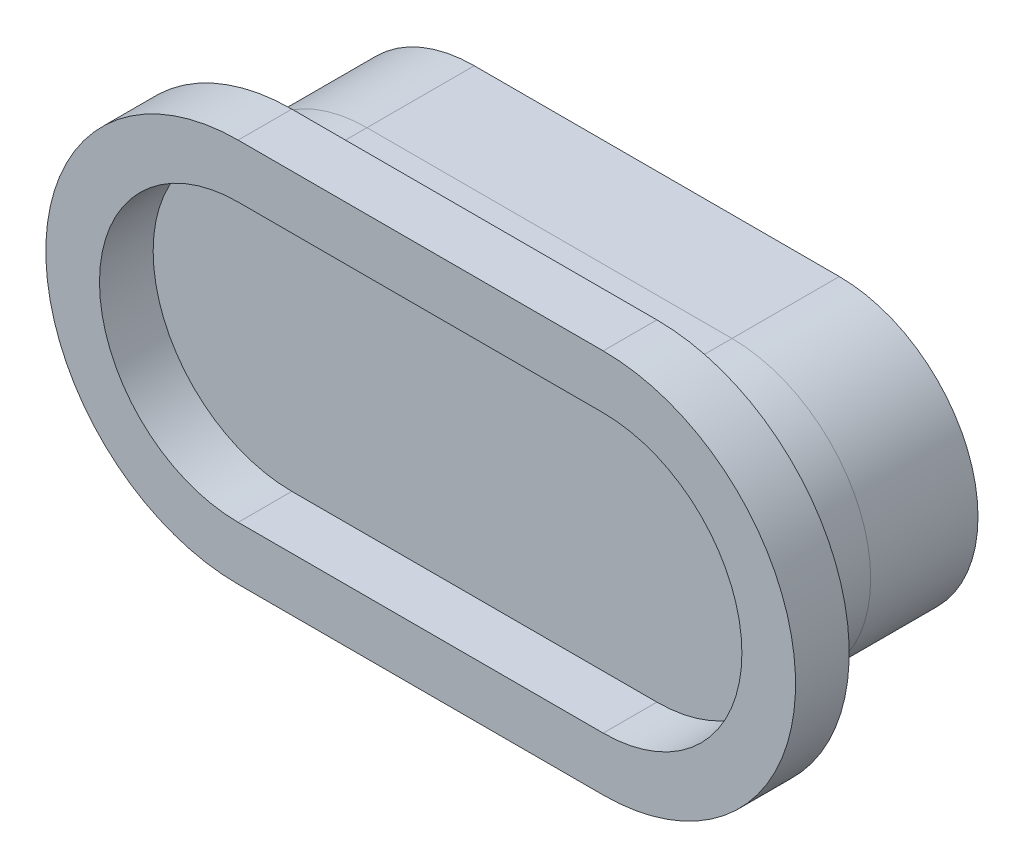
ISO-10303-21;
HEADER;
FILE_DESCRIPTION(('STEP AP214'),'2;1');
FILE_NAME('part.step','',(''),(''),'','','');
FILE_SCHEMA(('AUTOMOTIVE_DESIGN { 1 0 10303 214 1 1 1 1 }'));
ENDSEC;
DATA;
#1=APPLICATION_CONTEXT('core data for automotive mechanical design processes');
#2=APPLICATION_PROTOCOL_DEFINITION('international standard','automotive_design',2000,#1);
#3=PRODUCT_CONTEXT('',#1,'mechanical');
#4=PRODUCT('Part','Part','',(#3));
#5=PRODUCT_RELATED_PRODUCT_CATEGORY('part','',(#4));
#6=PRODUCT_DEFINITION_FORMATION('','',#4);
#7=PRODUCT_DEFINITION_CONTEXT('part definition',#1,'design');
#8=PRODUCT_DEFINITION('design','',#6,#7);
#9=PRODUCT_DEFINITION_SHAPE('','',#8);
#10=(LENGTH_UNIT() NAMED_UNIT(*) SI_UNIT(.MILLI.,.METRE.));
#11=(NAMED_UNIT(*) PLANE_ANGLE_UNIT() SI_UNIT($,.RADIAN.));
#12=(NAMED_UNIT(*) SI_UNIT($,.STERADIAN.) SOLID_ANGLE_UNIT());
#13=UNCERTAINTY_MEASURE_WITH_UNIT(LENGTH_MEASURE(1.E-05),#10,'distance_accuracy_value','');
#14=(GEOMETRIC_REPRESENTATION_CONTEXT(3) GLOBAL_UNCERTAINTY_ASSIGNED_CONTEXT((#13)) GLOBAL_UNIT_ASSIGNED_CONTEXT((#10,
#11,#12)) REPRESENTATION_CONTEXT('',''));
#15=CARTESIAN_POINT('',(0.,0.,0.));
#16=DIRECTION('',(0.,0.,1.));
#17=DIRECTION('',(1.,0.,0.));
#18=AXIS2_PLACEMENT_3D('',#15,#16,#17);
#19=CARTESIAN_POINT('',(68.0282062514295,0.,43.9999999999998));
#20=DIRECTION('',(0.,0.,1.));
#21=DIRECTION('',(1.,0.,0.));
#22=AXIS2_PLACEMENT_3D('',#19,#20,#21);
#23=PLANE('',#22);
#24=CARTESIAN_POINT('',(68.0282062514295,0.,43.9999999999998));
#25=DIRECTION('',(0.,0.,1.));
#26=DIRECTION('',(1.,0.,0.));
#27=AXIS2_PLACEMENT_3D('',#24,#25,#26);
#28=CIRCLE('',#27,35.8453618238699);
#29=CARTESIAN_POINT('',(68.0282062514295,-35.8453618238699,43.9999999999998));
#30=VERTEX_POINT('',#29);
#31=CARTESIAN_POINT('',(68.0282062514295,35.8453618238699,43.9999999999998));
#32=VERTEX_POINT('',#31);
#33=EDGE_CURVE('E175',#30,#32,#28,.T.);
#34=ORIENTED_EDGE('',*,*,#33,.T.);
#35=DIRECTION('',(-1.,0.,0.));
#36=VECTOR('',#35,1.);
#37=CARTESIAN_POINT('',(68.0282062514295,35.8453618238699,43.9999999999998));
#38=LINE('',#37,#36);
#39=CARTESIAN_POINT('',(0.,35.8453618238699,43.9999999999998));
#40=VERTEX_POINT('',#39);
#41=EDGE_CURVE('E178',#32,#40,#38,.T.);
#42=ORIENTED_EDGE('',*,*,#41,.T.);
#43=CARTESIAN_POINT('',(0.,0.,43.9999999999998));
#44=DIRECTION('',(0.,0.,1.));
#45=DIRECTION('',(1.,0.,0.));
#46=AXIS2_PLACEMENT_3D('',#43,#44,#45);
#47=CIRCLE('',#46,35.8453618238699);
#48=CARTESIAN_POINT('',(0.,-35.8453618238699,43.9999999999998));
#49=VERTEX_POINT('',#48);
#50=EDGE_CURVE('E181',#40,#49,#47,.T.);
#51=ORIENTED_EDGE('',*,*,#50,.T.);
#52=DIRECTION('',(1.,0.,0.));
#53=VECTOR('',#52,1.);
#54=CARTESIAN_POINT('',(0.,-35.8453618238699,43.9999999999998));
#55=LINE('',#54,#53);
#56=EDGE_CURVE('E183',#49,#30,#55,.T.);
#57=ORIENTED_EDGE('',*,*,#56,.T.);
#58=EDGE_LOOP('',(#34,#42,#51,#57));
#59=FACE_BOUND('',#58,.T.);
#60=DIRECTION('',(-1.,0.,0.));
#61=VECTOR('',#60,1.);
#62=CARTESIAN_POINT('',(68.0282062514295,25.8453618238699,43.9999999999998));
#63=LINE('',#62,#61);
#64=CARTESIAN_POINT('',(68.0282062514295,25.8453618238699,43.9999999999998));
#65=VERTEX_POINT('',#64);
#66=CARTESIAN_POINT('',(0.,25.8453618238699,43.9999999999998));
#67=VERTEX_POINT('',#66);
#68=EDGE_CURVE('E147',#65,#67,#63,.T.);
#69=ORIENTED_EDGE('',*,*,#68,.F.);
#70=CARTESIAN_POINT('',(68.0282062514295,0.,43.9999999999998));
#71=DIRECTION('',(0.,0.,1.));
#72=DIRECTION('',(1.,0.,0.));
#73=AXIS2_PLACEMENT_3D('',#70,#71,#72);
#74=CIRCLE('',#73,25.8453618238699);
#75=CARTESIAN_POINT('',(68.0282062514295,-25.8453618238699,43.9999999999998));
#76=VERTEX_POINT('',#75);
#77=EDGE_CURVE('E139',#76,#65,#74,.T.);
#78=ORIENTED_EDGE('',*,*,#77,.F.);
#79=DIRECTION('',(1.,0.,0.));
#80=VECTOR('',#79,1.);
#81=CARTESIAN_POINT('',(0.,-25.8453618238699,43.9999999999998));
#82=LINE('',#81,#80);
#83=CARTESIAN_POINT('',(0.,-25.8453618238699,43.9999999999998));
#84=VERTEX_POINT('',#83);
#85=EDGE_CURVE('E161',#84,#76,#82,.T.);
#86=ORIENTED_EDGE('',*,*,#85,.F.);
#87=CARTESIAN_POINT('',(0.,0.,43.9999999999998));
#88=DIRECTION('',(0.,0.,1.));
#89=DIRECTION('',(1.,0.,0.));
#90=AXIS2_PLACEMENT_3D('',#87,#88,#89);
#91=CIRCLE('',#90,25.8453618238699);
#92=EDGE_CURVE('E159',#67,#84,#91,.T.);
#93=ORIENTED_EDGE('',*,*,#92,.F.);
#94=EDGE_LOOP('',(#69,#78,#86,#93));
#95=FACE_BOUND('',#94,.T.);
#96=ADVANCED_FACE('F74',(#59,#95),#23,.T.);
#97=CARTESIAN_POINT('',(68.0282062514295,0.,33.9999999999998));
#98=DIRECTION('',(0.,0.,1.));
#99=DIRECTION('',(1.,0.,0.));
#100=AXIS2_PLACEMENT_3D('',#97,#98,#99);
#101=PLANE('',#100);
#102=CARTESIAN_POINT('',(68.0282062514295,0.,33.9999999999998));
#103=DIRECTION('',(0.,0.,1.));
#104=DIRECTION('',(1.,0.,0.));
#105=AXIS2_PLACEMENT_3D('',#102,#103,#104);
#106=CIRCLE('',#105,35.8453618238699);
#107=CARTESIAN_POINT('',(68.0282062514295,-35.8453618238699,33.9999999999998));
#108=VERTEX_POINT('',#107);
#109=CARTESIAN_POINT('',(68.0282062514295,35.8453618238699,33.9999999999998));
#110=VERTEX_POINT('',#109);
#111=EDGE_CURVE('E155',#108,#110,#106,.T.);
#112=ORIENTED_EDGE('',*,*,#111,.F.);
#113=DIRECTION('',(1.,0.,0.));
#114=VECTOR('',#113,1.);
#115=CARTESIAN_POINT('',(0.,-35.8453618238699,33.9999999999998));
#116=LINE('',#115,#114);
#117=CARTESIAN_POINT('',(0.,-35.8453618238699,33.9999999999998));
#118=VERTEX_POINT('',#117);
#119=EDGE_CURVE('E179',#118,#108,#116,.T.);
#120=ORIENTED_EDGE('',*,*,#119,.F.);
#121=CARTESIAN_POINT('',(0.,0.,33.9999999999998));
#122=DIRECTION('',(0.,0.,1.));
#123=DIRECTION('',(1.,0.,0.));
#124=AXIS2_PLACEMENT_3D('',#121,#122,#123);
#125=CIRCLE('',#124,35.8453618238699);
#126=CARTESIAN_POINT('',(0.,35.8453618238699,33.9999999999998));
#127=VERTEX_POINT('',#126);
#128=EDGE_CURVE('E190',#127,#118,#125,.T.);
#129=ORIENTED_EDGE('',*,*,#128,.F.);
#130=DIRECTION('',(-1.,0.,0.));
#131=VECTOR('',#130,1.);
#132=CARTESIAN_POINT('',(68.0282062514295,35.8453618238699,33.9999999999998));
#133=LINE('',#132,#131);
#134=EDGE_CURVE('E188',#110,#127,#133,.T.);
#135=ORIENTED_EDGE('',*,*,#134,.F.);
#136=EDGE_LOOP('',(#112,#120,#129,#135));
#137=FACE_BOUND('',#136,.T.);
#138=CARTESIAN_POINT('',(68.0282062514295,0.,33.9999999999998));
#139=DIRECTION('',(0.,0.,1.));
#140=DIRECTION('',(1.,0.,0.));
#141=AXIS2_PLACEMENT_3D('',#138,#139,#140);
#142=CIRCLE('',#141,25.8453618238699);
#143=CARTESIAN_POINT('',(68.0282062514295,-25.8453618238699,33.9999999999998));
#144=VERTEX_POINT('',#143);
#145=CARTESIAN_POINT('',(68.0282062514295,25.8453618238699,33.9999999999998));
#146=VERTEX_POINT('',#145);
#147=EDGE_CURVE('E97',#144,#146,#142,.T.);
#148=ORIENTED_EDGE('',*,*,#147,.T.);
#149=DIRECTION('',(-1.,0.,0.));
#150=VECTOR('',#149,1.);
#151=CARTESIAN_POINT('',(68.0282062514295,25.8453618238699,33.9999999999998));
#152=LINE('',#151,#150);
#153=CARTESIAN_POINT('',(0.,25.8453618238699,33.9999999999998));
#154=VERTEX_POINT('',#153);
#155=EDGE_CURVE('E154',#146,#154,#152,.T.);
#156=ORIENTED_EDGE('',*,*,#155,.T.);
#157=CARTESIAN_POINT('',(0.,0.,33.9999999999998));
#158=DIRECTION('',(0.,0.,1.));
#159=DIRECTION('',(1.,0.,0.));
#160=AXIS2_PLACEMENT_3D('',#157,#158,#159);
#161=CIRCLE('',#160,25.8453618238699);
#162=CARTESIAN_POINT('',(0.,-25.8453618238699,33.9999999999998));
#163=VERTEX_POINT('',#162);
#164=EDGE_CURVE('E167',#154,#163,#161,.T.);
#165=ORIENTED_EDGE('',*,*,#164,.T.);
#166=DIRECTION('',(1.,0.,0.));
#167=VECTOR('',#166,1.);
#168=CARTESIAN_POINT('',(0.,-25.8453618238699,33.9999999999998));
#169=LINE('',#168,#167);
#170=EDGE_CURVE('E148',#163,#144,#169,.T.);
#171=ORIENTED_EDGE('',*,*,#170,.T.);
#172=EDGE_LOOP('',(#148,#156,#165,#171));
#173=FACE_BOUND('',#172,.T.);
#174=ADVANCED_FACE('F208',(#137,#173),#101,.F.);
#175=CARTESIAN_POINT('',(68.0282062514295,0.,43.9999999999998));
#176=DIRECTION('',(0.,0.,-1.));
#177=DIRECTION('',(-1.,0.,0.));
#178=AXIS2_PLACEMENT_3D('',#175,#176,#177);
#179=CYLINDRICAL_SURFACE('',#178,35.8453618238699);
#180=ORIENTED_EDGE('',*,*,#111,.T.);
#181=DIRECTION('',(0.,0.,-1.));
#182=VECTOR('',#181,1.);
#183=CARTESIAN_POINT('',(68.0282062514295,35.8453618238699,43.9999999999998));
#184=LINE('',#183,#182);
#185=EDGE_CURVE('E13',#32,#110,#184,.T.);
#186=ORIENTED_EDGE('',*,*,#185,.F.);
#187=ORIENTED_EDGE('',*,*,#33,.F.);
#188=DIRECTION('',(0.,0.,-1.));
#189=VECTOR('',#188,1.);
#190=CARTESIAN_POINT('',(68.0282062514295,-35.8453618238699,43.9999999999998));
#191=LINE('',#190,#189);
#192=EDGE_CURVE('E185',#30,#108,#191,.T.);
#193=ORIENTED_EDGE('',*,*,#192,.T.);
#194=EDGE_LOOP('',(#180,#186,#187,#193));
#195=FACE_BOUND('',#194,.T.);
#196=ADVANCED_FACE('F76',(#195),#179,.T.);
#197=CARTESIAN_POINT('',(68.0282062514295,35.8453618238699,43.9999999999998));
#198=DIRECTION('',(0.,-1.,0.));
#199=DIRECTION('',(0.,0.,-1.));
#200=AXIS2_PLACEMENT_3D('',#197,#198,#199);
#201=PLANE('',#200);
#202=ORIENTED_EDGE('',*,*,#134,.T.);
#203=DIRECTION('',(0.,0.,-1.));
#204=VECTOR('',#203,1.);
#205=CARTESIAN_POINT('',(0.,35.8453618238699,43.9999999999998));
#206=LINE('',#205,#204);
#207=EDGE_CURVE('E82',#40,#127,#206,.T.);
#208=ORIENTED_EDGE('',*,*,#207,.F.);
#209=ORIENTED_EDGE('',*,*,#41,.F.);
#210=ORIENTED_EDGE('',*,*,#185,.T.);
#211=EDGE_LOOP('',(#202,#208,#209,#210));
#212=FACE_BOUND('',#211,.T.);
#213=ADVANCED_FACE('F218',(#212),#201,.F.);
#214=CARTESIAN_POINT('',(0.,0.,43.9999999999998));
#215=DIRECTION('',(0.,0.,-1.));
#216=DIRECTION('',(-1.,0.,0.));
#217=AXIS2_PLACEMENT_3D('',#214,#215,#216);
#218=CYLINDRICAL_SURFACE('',#217,35.8453618238699);
#219=ORIENTED_EDGE('',*,*,#128,.T.);
#220=DIRECTION('',(0.,0.,-1.));
#221=VECTOR('',#220,1.);
#222=CARTESIAN_POINT('',(0.,-35.8453618238699,43.9999999999998));
#223=LINE('',#222,#221);
#224=EDGE_CURVE('E195',#49,#118,#223,.T.);
#225=ORIENTED_EDGE('',*,*,#224,.F.);
#226=ORIENTED_EDGE('',*,*,#50,.F.);
#227=ORIENTED_EDGE('',*,*,#207,.T.);
#228=EDGE_LOOP('',(#219,#225,#226,#227));
#229=FACE_BOUND('',#228,.T.);
#230=ADVANCED_FACE('F202',(#229),#218,.T.);
#231=CARTESIAN_POINT('',(0.,-35.8453618238699,43.9999999999998));
#232=DIRECTION('',(0.,1.,0.));
#233=DIRECTION('',(0.,0.,1.));
#234=AXIS2_PLACEMENT_3D('',#231,#232,#233);
#235=PLANE('',#234);
#236=ORIENTED_EDGE('',*,*,#119,.T.);
#237=ORIENTED_EDGE('',*,*,#192,.F.);
#238=ORIENTED_EDGE('',*,*,#56,.F.);
#239=ORIENTED_EDGE('',*,*,#224,.T.);
#240=EDGE_LOOP('',(#236,#237,#238,#239));
#241=FACE_BOUND('',#240,.T.);
#242=ADVANCED_FACE('F212',(#241),#235,.F.);
#243=CARTESIAN_POINT('',(68.0282062514295,0.,43.9999999999998));
#244=DIRECTION('',(0.,0.,-1.));
#245=DIRECTION('',(-1.,0.,0.));
#246=AXIS2_PLACEMENT_3D('',#243,#244,#245);
#247=CYLINDRICAL_SURFACE('',#246,25.8453618238699);
#248=ORIENTED_EDGE('',*,*,#147,.F.);
#249=DIRECTION('',(0.,0.,-1.));
#250=VECTOR('',#249,1.);
#251=CARTESIAN_POINT('',(68.0282062514295,-25.8453618238699,43.9999999999998));
#252=LINE('',#251,#250);
#253=EDGE_CURVE('E143',#76,#144,#252,.T.);
#254=ORIENTED_EDGE('',*,*,#253,.F.);
#255=ORIENTED_EDGE('',*,*,#77,.T.);
#256=DIRECTION('',(0.,0.,-1.));
#257=VECTOR('',#256,1.);
#258=CARTESIAN_POINT('',(68.0282062514295,25.8453618238699,43.9999999999998));
#259=LINE('',#258,#257);
#260=EDGE_CURVE('E142',#65,#146,#259,.T.);
#261=ORIENTED_EDGE('',*,*,#260,.T.);
#262=EDGE_LOOP('',(#248,#254,#255,#261));
#263=FACE_BOUND('',#262,.T.);
#264=ADVANCED_FACE('F141',(#263),#247,.F.);
#265=CARTESIAN_POINT('',(68.0282062514295,25.8453618238699,43.9999999999998));
#266=DIRECTION('',(0.,-1.,0.));
#267=DIRECTION('',(0.,0.,-1.));
#268=AXIS2_PLACEMENT_3D('',#265,#266,#267);
#269=PLANE('',#268);
#270=ORIENTED_EDGE('',*,*,#155,.F.);
#271=ORIENTED_EDGE('',*,*,#260,.F.);
#272=ORIENTED_EDGE('',*,*,#68,.T.);
#273=DIRECTION('',(0.,0.,-1.));
#274=VECTOR('',#273,1.);
#275=CARTESIAN_POINT('',(0.,25.8453618238699,43.9999999999998));
#276=LINE('',#275,#274);
#277=EDGE_CURVE('E156',#67,#154,#276,.T.);
#278=ORIENTED_EDGE('',*,*,#277,.T.);
#279=EDGE_LOOP('',(#270,#271,#272,#278));
#280=FACE_BOUND('',#279,.T.);
#281=ADVANCED_FACE('F151',(#280),#269,.T.);
#282=CARTESIAN_POINT('',(0.,0.,43.9999999999998));
#283=DIRECTION('',(0.,0.,-1.));
#284=DIRECTION('',(-1.,0.,0.));
#285=AXIS2_PLACEMENT_3D('',#282,#283,#284);
#286=CYLINDRICAL_SURFACE('',#285,25.8453618238699);
#287=ORIENTED_EDGE('',*,*,#164,.F.);
#288=ORIENTED_EDGE('',*,*,#277,.F.);
#289=ORIENTED_EDGE('',*,*,#92,.T.);
#290=DIRECTION('',(0.,0.,-1.));
#291=VECTOR('',#290,1.);
#292=CARTESIAN_POINT('',(0.,-25.8453618238699,43.9999999999998));
#293=LINE('',#292,#291);
#294=EDGE_CURVE('E89',#84,#163,#293,.T.);
#295=ORIENTED_EDGE('',*,*,#294,.T.);
#296=EDGE_LOOP('',(#287,#288,#289,#295));
#297=FACE_BOUND('',#296,.T.);
#298=ADVANCED_FACE('F241',(#297),#286,.F.);
#299=CARTESIAN_POINT('',(0.,-25.8453618238699,43.9999999999998));
#300=DIRECTION('',(0.,1.,0.));
#301=DIRECTION('',(0.,0.,1.));
#302=AXIS2_PLACEMENT_3D('',#299,#300,#301);
#303=PLANE('',#302);
#304=ORIENTED_EDGE('',*,*,#170,.F.);
#305=ORIENTED_EDGE('',*,*,#294,.F.);
#306=ORIENTED_EDGE('',*,*,#85,.T.);
#307=ORIENTED_EDGE('',*,*,#253,.T.);
#308=EDGE_LOOP('',(#304,#305,#306,#307));
#309=FACE_BOUND('',#308,.T.);
#310=ADVANCED_FACE('F245',(#309),#303,.T.);
#311=CLOSED_SHELL('',(#96,#174,#196,#213,#230,#242,#264,#281,#298,#310));
#312=MANIFOLD_SOLID_BREP('B2',#311);
#313=CARTESIAN_POINT('',(68.0282062514295,25.8453618238699,33.9999999999998));
#314=DIRECTION('',(0.,-1.,0.));
#315=DIRECTION('',(0.,0.,-1.));
#316=AXIS2_PLACEMENT_3D('',#313,#314,#315);
#317=PLANE('',#316);
#318=DIRECTION('',(-1.,0.,0.));
#319=VECTOR('',#318,1.);
#320=CARTESIAN_POINT('',(68.0282062514295,25.8453618238699,20.));
#321=LINE('',#320,#319);
#322=CARTESIAN_POINT('',(68.0282062514295,25.8453618238699,20.));
#323=VERTEX_POINT('',#322);
#324=CARTESIAN_POINT('',(0.,25.8453618238699,20.));
#325=VERTEX_POINT('',#324);
#326=EDGE_CURVE('E376',#323,#325,#321,.T.);
#327=ORIENTED_EDGE('',*,*,#326,.T.);
#328=DIRECTION('',(0.,0.,-1.));
#329=VECTOR('',#328,1.);
#330=CARTESIAN_POINT('',(0.,25.8453618238699,33.9999999999998));
#331=LINE('',#330,#329);
#332=CARTESIAN_POINT('',(0.,25.8453618238699,33.9999999999998));
#333=VERTEX_POINT('',#332);
#334=EDGE_CURVE('E72',#333,#325,#331,.T.);
#335=ORIENTED_EDGE('',*,*,#334,.F.);
#336=DIRECTION('',(-1.,0.,0.));
#337=VECTOR('',#336,1.);
#338=CARTESIAN_POINT('',(68.0282062514295,25.8453618238699,33.9999999999998));
#339=LINE('',#338,#337);
#340=CARTESIAN_POINT('',(68.0282062514295,25.8453618238699,33.9999999999998));
#341=VERTEX_POINT('',#340);
#342=EDGE_CURVE('E364',#341,#333,#339,.T.);
#343=ORIENTED_EDGE('',*,*,#342,.F.);
#344=DIRECTION('',(0.,0.,-1.));
#345=VECTOR('',#344,1.);
#346=CARTESIAN_POINT('',(68.0282062514295,25.8453618238699,33.9999999999998));
#347=LINE('',#346,#345);
#348=EDGE_CURVE('E372',#341,#323,#347,.T.);
#349=ORIENTED_EDGE('',*,*,#348,.T.);
#350=EDGE_LOOP('',(#327,#335,#343,#349));
#351=FACE_BOUND('',#350,.T.);
#352=ADVANCED_FACE('F313',(#351),#317,.F.);
#353=CARTESIAN_POINT('',(0.,0.,33.9999999999998));
#354=DIRECTION('',(0.,0.,-1.));
#355=DIRECTION('',(-1.,0.,0.));
#356=AXIS2_PLACEMENT_3D('',#353,#354,#355);
#357=CYLINDRICAL_SURFACE('',#356,25.8453618238699);
#358=CARTESIAN_POINT('',(0.,0.,20.));
#359=DIRECTION('',(0.,0.,1.));
#360=DIRECTION('',(1.,0.,0.));
#361=AXIS2_PLACEMENT_3D('',#358,#359,#360);
#362=CIRCLE('',#361,25.8453618238699);
#363=CARTESIAN_POINT('',(0.,-25.8453618238699,20.));
#364=VERTEX_POINT('',#363);
#365=EDGE_CURVE('E368',#325,#364,#362,.T.);
#366=ORIENTED_EDGE('',*,*,#365,.T.);
#367=DIRECTION('',(0.,0.,-1.));
#368=VECTOR('',#367,1.);
#369=CARTESIAN_POINT('',(0.,-25.8453618238699,33.9999999999998));
#370=LINE('',#369,#368);
#371=CARTESIAN_POINT('',(0.,-25.8453618238699,33.9999999999998));
#372=VERTEX_POINT('',#371);
#373=EDGE_CURVE('E321',#372,#364,#370,.T.);
#374=ORIENTED_EDGE('',*,*,#373,.F.);
#375=CARTESIAN_POINT('',(0.,0.,33.9999999999998));
#376=DIRECTION('',(0.,0.,1.));
#377=DIRECTION('',(1.,0.,0.));
#378=AXIS2_PLACEMENT_3D('',#375,#376,#377);
#379=CIRCLE('',#378,25.8453618238699);
#380=EDGE_CURVE('E359',#333,#372,#379,.T.);
#381=ORIENTED_EDGE('',*,*,#380,.F.);
#382=ORIENTED_EDGE('',*,*,#334,.T.);
#383=EDGE_LOOP('',(#366,#374,#381,#382));
#384=FACE_BOUND('',#383,.T.);
#385=ADVANCED_FACE('F367',(#384),#357,.T.);
#386=CARTESIAN_POINT('',(0.,-25.8453618238699,33.9999999999998));
#387=DIRECTION('',(0.,1.,0.));
#388=DIRECTION('',(0.,0.,1.));
#389=AXIS2_PLACEMENT_3D('',#386,#387,#388);
#390=PLANE('',#389);
#391=DIRECTION('',(1.,0.,0.));
#392=VECTOR('',#391,1.);
#393=CARTESIAN_POINT('',(0.,-25.8453618238699,20.));
#394=LINE('',#393,#392);
#395=CARTESIAN_POINT('',(68.0282062514295,-25.8453618238699,20.));
#396=VERTEX_POINT('',#395);
#397=EDGE_CURVE('E346',#364,#396,#394,.T.);
#398=ORIENTED_EDGE('',*,*,#397,.T.);
#399=DIRECTION('',(0.,0.,-1.));
#400=VECTOR('',#399,1.);
#401=CARTESIAN_POINT('',(68.0282062514295,-25.8453618238699,33.9999999999998));
#402=LINE('',#401,#400);
#403=CARTESIAN_POINT('',(68.0282062514295,-25.8453618238699,33.9999999999998));
#404=VERTEX_POINT('',#403);
#405=EDGE_CURVE('E369',#404,#396,#402,.T.);
#406=ORIENTED_EDGE('',*,*,#405,.F.);
#407=DIRECTION('',(1.,0.,0.));
#408=VECTOR('',#407,1.);
#409=CARTESIAN_POINT('',(0.,-25.8453618238699,33.9999999999998));
#410=LINE('',#409,#408);
#411=EDGE_CURVE('E362',#372,#404,#410,.T.);
#412=ORIENTED_EDGE('',*,*,#411,.F.);
#413=ORIENTED_EDGE('',*,*,#373,.T.);
#414=EDGE_LOOP('',(#398,#406,#412,#413));
#415=FACE_BOUND('',#414,.T.);
#416=ADVANCED_FACE('F370',(#415),#390,.F.);
#417=CARTESIAN_POINT('',(68.0282062514295,0.,33.9999999999998));
#418=DIRECTION('',(0.,0.,-1.));
#419=DIRECTION('',(-1.,0.,0.));
#420=AXIS2_PLACEMENT_3D('',#417,#418,#419);
#421=CYLINDRICAL_SURFACE('',#420,25.8453618238699);
#422=CARTESIAN_POINT('',(68.0282062514295,0.,20.));
#423=DIRECTION('',(0.,0.,1.));
#424=DIRECTION('',(1.,0.,0.));
#425=AXIS2_PLACEMENT_3D('',#422,#423,#424);
#426=CIRCLE('',#425,25.8453618238699);
#427=EDGE_CURVE('E352',#396,#323,#426,.T.);
#428=ORIENTED_EDGE('',*,*,#427,.T.);
#429=ORIENTED_EDGE('',*,*,#348,.F.);
#430=CARTESIAN_POINT('',(68.0282062514295,0.,33.9999999999998));
#431=DIRECTION('',(0.,0.,1.));
#432=DIRECTION('',(1.,0.,0.));
#433=AXIS2_PLACEMENT_3D('',#430,#431,#432);
#434=CIRCLE('',#433,25.8453618238699);
#435=EDGE_CURVE('E329',#404,#341,#434,.T.);
#436=ORIENTED_EDGE('',*,*,#435,.F.);
#437=ORIENTED_EDGE('',*,*,#405,.T.);
#438=EDGE_LOOP('',(#428,#429,#436,#437));
#439=FACE_BOUND('',#438,.T.);
#440=ADVANCED_FACE('F383',(#439),#421,.T.);
#441=CARTESIAN_POINT('',(0.,0.,33.9999999999998));
#442=DIRECTION('',(0.,0.,1.));
#443=DIRECTION('',(1.,0.,0.));
#444=AXIS2_PLACEMENT_3D('',#441,#442,#443);
#445=PLANE('',#444);
#446=ORIENTED_EDGE('',*,*,#342,.T.);
#447=ORIENTED_EDGE('',*,*,#380,.T.);
#448=ORIENTED_EDGE('',*,*,#411,.T.);
#449=ORIENTED_EDGE('',*,*,#435,.T.);
#450=EDGE_LOOP('',(#446,#447,#448,#449));
#451=FACE_BOUND('',#450,.T.);
#452=ADVANCED_FACE('F360',(#451),#445,.T.);
#453=CARTESIAN_POINT('',(0.,0.,20.));
#454=DIRECTION('',(0.,0.,1.));
#455=DIRECTION('',(1.,0.,0.));
#456=AXIS2_PLACEMENT_3D('',#453,#454,#455);
#457=PLANE('',#456);
#458=ORIENTED_EDGE('',*,*,#326,.F.);
#459=ORIENTED_EDGE('',*,*,#427,.F.);
#460=ORIENTED_EDGE('',*,*,#397,.F.);
#461=ORIENTED_EDGE('',*,*,#365,.F.);
#462=EDGE_LOOP('',(#458,#459,#460,#461));
#463=FACE_BOUND('',#462,.T.);
#464=ADVANCED_FACE('F386',(#463),#457,.F.);
#465=CLOSED_SHELL('',(#352,#385,#416,#440,#452,#464));
#466=MANIFOLD_SOLID_BREP('B7',#465);
#467=CARTESIAN_POINT('',(0.,0.,20.));
#468=DIRECTION('',(0.,0.,-1.));
#469=DIRECTION('',(-1.,0.,0.));
#470=AXIS2_PLACEMENT_3D('',#467,#468,#469);
#471=CYLINDRICAL_SURFACE('',#470,25.8453618238699);
#472=CARTESIAN_POINT('',(0.,0.,0.));
#473=DIRECTION('',(0.,0.,1.));
#474=DIRECTION('',(1.,0.,0.));
#475=AXIS2_PLACEMENT_3D('',#472,#473,#474);
#476=CIRCLE('',#475,25.8453618238699);
#477=CARTESIAN_POINT('',(0.,25.8453618238699,0.));
#478=VERTEX_POINT('',#477);
#479=CARTESIAN_POINT('',(0.,-25.8453618238699,0.));
#480=VERTEX_POINT('',#479);
#481=EDGE_CURVE('E505',#478,#480,#476,.T.);
#482=ORIENTED_EDGE('',*,*,#481,.T.);
#483=DIRECTION('',(0.,0.,-1.));
#484=VECTOR('',#483,1.);
#485=CARTESIAN_POINT('',(0.,-25.8453618238699,20.));
#486=LINE('',#485,#484);
#487=CARTESIAN_POINT('',(0.,-25.8453618238699,20.));
#488=VERTEX_POINT('',#487);
#489=EDGE_CURVE('E311',#488,#480,#486,.T.);
#490=ORIENTED_EDGE('',*,*,#489,.F.);
#491=CARTESIAN_POINT('',(0.,0.,20.));
#492=DIRECTION('',(0.,0.,1.));
#493=DIRECTION('',(1.,0.,0.));
#494=AXIS2_PLACEMENT_3D('',#491,#492,#493);
#495=CIRCLE('',#494,25.8453618238699);
#496=CARTESIAN_POINT('',(0.,25.8453618238699,20.));
#497=VERTEX_POINT('',#496);
#498=EDGE_CURVE('E487',#497,#488,#495,.T.);
#499=ORIENTED_EDGE('',*,*,#498,.F.);
#500=DIRECTION('',(0.,0.,-1.));
#501=VECTOR('',#500,1.);
#502=CARTESIAN_POINT('',(0.,25.8453618238699,20.));
#503=LINE('',#502,#501);
#504=EDGE_CURVE('E454',#497,#478,#503,.T.);
#505=ORIENTED_EDGE('',*,*,#504,.T.);
#506=EDGE_LOOP('',(#482,#490,#499,#505));
#507=FACE_BOUND('',#506,.T.);
#508=ADVANCED_FACE('F437',(#507),#471,.T.);
#509=CARTESIAN_POINT('',(0.,-25.8453618238699,20.));
#510=DIRECTION('',(0.,1.,0.));
#511=DIRECTION('',(0.,0.,1.));
#512=AXIS2_PLACEMENT_3D('',#509,#510,#511);
#513=PLANE('',#512);
#514=DIRECTION('',(1.,0.,0.));
#515=VECTOR('',#514,1.);
#516=CARTESIAN_POINT('',(0.,-25.8453618238699,0.));
#517=LINE('',#516,#515);
#518=CARTESIAN_POINT('',(68.0282062514295,-25.8453618238699,0.));
#519=VERTEX_POINT('',#518);
#520=EDGE_CURVE('E493',#480,#519,#517,.T.);
#521=ORIENTED_EDGE('',*,*,#520,.T.);
#522=DIRECTION('',(0.,0.,-1.));
#523=VECTOR('',#522,1.);
#524=CARTESIAN_POINT('',(68.0282062514295,-25.8453618238699,20.));
#525=LINE('',#524,#523);
#526=CARTESIAN_POINT('',(68.0282062514295,-25.8453618238699,20.));
#527=VERTEX_POINT('',#526);
#528=EDGE_CURVE('E446',#527,#519,#525,.T.);
#529=ORIENTED_EDGE('',*,*,#528,.F.);
#530=DIRECTION('',(1.,0.,0.));
#531=VECTOR('',#530,1.);
#532=CARTESIAN_POINT('',(0.,-25.8453618238699,20.));
#533=LINE('',#532,#531);
#534=EDGE_CURVE('E480',#488,#527,#533,.T.);
#535=ORIENTED_EDGE('',*,*,#534,.F.);
#536=ORIENTED_EDGE('',*,*,#489,.T.);
#537=EDGE_LOOP('',(#521,#529,#535,#536));
#538=FACE_BOUND('',#537,.T.);
#539=ADVANCED_FACE('F492',(#538),#513,.F.);
#540=CARTESIAN_POINT('',(68.0282062514295,0.,20.));
#541=DIRECTION('',(0.,0.,-1.));
#542=DIRECTION('',(-1.,0.,0.));
#543=AXIS2_PLACEMENT_3D('',#540,#541,#542);
#544=CYLINDRICAL_SURFACE('',#543,25.8453618238699);
#545=CARTESIAN_POINT('',(68.0282062514295,0.,0.));
#546=DIRECTION('',(0.,0.,1.));
#547=DIRECTION('',(1.,0.,0.));
#548=AXIS2_PLACEMENT_3D('',#545,#546,#547);
#549=CIRCLE('',#548,25.8453618238699);
#550=CARTESIAN_POINT('',(68.0282062514295,25.8453618238699,0.));
#551=VERTEX_POINT('',#550);
#552=EDGE_CURVE('E510',#519,#551,#549,.T.);
#553=ORIENTED_EDGE('',*,*,#552,.T.);
#554=DIRECTION('',(0.,0.,-1.));
#555=VECTOR('',#554,1.);
#556=CARTESIAN_POINT('',(68.0282062514295,25.8453618238699,20.));
#557=LINE('',#556,#555);
#558=CARTESIAN_POINT('',(68.0282062514295,25.8453618238699,20.));
#559=VERTEX_POINT('',#558);
#560=EDGE_CURVE('E469',#559,#551,#557,.T.);
#561=ORIENTED_EDGE('',*,*,#560,.F.);
#562=CARTESIAN_POINT('',(68.0282062514295,0.,20.));
#563=DIRECTION('',(0.,0.,1.));
#564=DIRECTION('',(1.,0.,0.));
#565=AXIS2_PLACEMENT_3D('',#562,#563,#564);
#566=CIRCLE('',#565,25.8453618238699);
#567=EDGE_CURVE('E486',#527,#559,#566,.T.);
#568=ORIENTED_EDGE('',*,*,#567,.F.);
#569=ORIENTED_EDGE('',*,*,#528,.T.);
#570=EDGE_LOOP('',(#553,#561,#568,#569));
#571=FACE_BOUND('',#570,.T.);
#572=ADVANCED_FACE('F497',(#571),#544,.T.);
#573=CARTESIAN_POINT('',(0.,25.8453618238699,20.));
#574=DIRECTION('',(0.,1.,0.));
#575=DIRECTION('',(0.,0.,1.));
#576=AXIS2_PLACEMENT_3D('',#573,#574,#575);
#577=PLANE('',#576);
#578=DIRECTION('',(1.,0.,0.));
#579=VECTOR('',#578,1.);
#580=CARTESIAN_POINT('',(0.,25.8453618238699,0.));
#581=LINE('',#580,#579);
#582=EDGE_CURVE('E513',#478,#551,#581,.T.);
#583=ORIENTED_EDGE('',*,*,#582,.F.);
#584=ORIENTED_EDGE('',*,*,#504,.F.);
#585=DIRECTION('',(1.,0.,0.));
#586=VECTOR('',#585,1.);
#587=CARTESIAN_POINT('',(0.,25.8453618238699,20.));
#588=LINE('',#587,#586);
#589=EDGE_CURVE('E499',#497,#559,#588,.T.);
#590=ORIENTED_EDGE('',*,*,#589,.T.);
#591=ORIENTED_EDGE('',*,*,#560,.T.);
#592=EDGE_LOOP('',(#583,#584,#590,#591));
#593=FACE_BOUND('',#592,.T.);
#594=ADVANCED_FACE('F523',(#593),#577,.T.);
#595=CARTESIAN_POINT('',(0.,0.,20.));
#596=DIRECTION('',(0.,0.,1.));
#597=DIRECTION('',(1.,0.,0.));
#598=AXIS2_PLACEMENT_3D('',#595,#596,#597);
#599=PLANE('',#598);
#600=ORIENTED_EDGE('',*,*,#498,.T.);
#601=ORIENTED_EDGE('',*,*,#534,.T.);
#602=ORIENTED_EDGE('',*,*,#567,.T.);
#603=ORIENTED_EDGE('',*,*,#589,.F.);
#604=EDGE_LOOP('',(#600,#601,#602,#603));
#605=FACE_BOUND('',#604,.T.);
#606=ADVANCED_FACE('F483',(#605),#599,.T.);
#607=CARTESIAN_POINT('',(0.,0.,0.));
#608=DIRECTION('',(0.,0.,1.));
#609=DIRECTION('',(1.,0.,0.));
#610=AXIS2_PLACEMENT_3D('',#607,#608,#609);
#611=PLANE('',#610);
#612=ORIENTED_EDGE('',*,*,#481,.F.);
#613=ORIENTED_EDGE('',*,*,#582,.T.);
#614=ORIENTED_EDGE('',*,*,#552,.F.);
#615=ORIENTED_EDGE('',*,*,#520,.F.);
#616=EDGE_LOOP('',(#612,#613,#614,#615));
#617=FACE_BOUND('',#616,.T.);
#618=ADVANCED_FACE('F522',(#617),#611,.F.);
#619=CLOSED_SHELL('',(#508,#539,#572,#594,#606,#618));
#620=MANIFOLD_SOLID_BREP('B66',#619);
#621=ADVANCED_BREP_SHAPE_REPRESENTATION('',(#18,#312,#466,#620),#14);
#622=SHAPE_DEFINITION_REPRESENTATION(#9,#621);
ENDSEC;
END-ISO-10303-21;
